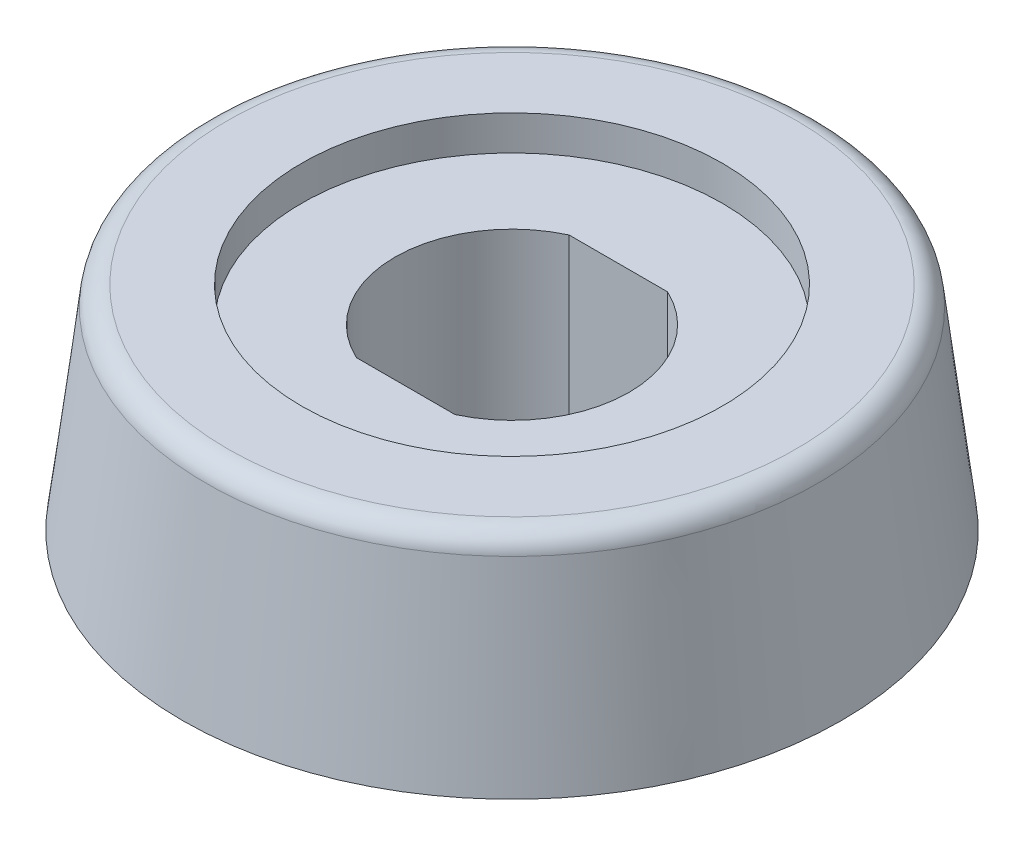
ISO-10303-21;
HEADER;
FILE_DESCRIPTION(('STEP AP214'),'2;1');
FILE_NAME('part.step','',(''),(''),'','','');
FILE_SCHEMA(('AUTOMOTIVE_DESIGN { 1 0 10303 214 1 1 1 1 }'));
ENDSEC;
DATA;
#1=APPLICATION_CONTEXT('core data for automotive mechanical design processes');
#2=APPLICATION_PROTOCOL_DEFINITION('international standard','automotive_design',2000,#1);
#3=PRODUCT_CONTEXT('',#1,'mechanical');
#4=PRODUCT('Part','Part','',(#3));
#5=PRODUCT_RELATED_PRODUCT_CATEGORY('part','',(#4));
#6=PRODUCT_DEFINITION_FORMATION('','',#4);
#7=PRODUCT_DEFINITION_CONTEXT('part definition',#1,'design');
#8=PRODUCT_DEFINITION('design','',#6,#7);
#9=PRODUCT_DEFINITION_SHAPE('','',#8);
#10=(LENGTH_UNIT() NAMED_UNIT(*) SI_UNIT(.MILLI.,.METRE.));
#11=(NAMED_UNIT(*) PLANE_ANGLE_UNIT() SI_UNIT($,.RADIAN.));
#12=(NAMED_UNIT(*) SI_UNIT($,.STERADIAN.) SOLID_ANGLE_UNIT());
#13=UNCERTAINTY_MEASURE_WITH_UNIT(LENGTH_MEASURE(1.E-05),#10,'distance_accuracy_value','');
#14=(GEOMETRIC_REPRESENTATION_CONTEXT(3) GLOBAL_UNCERTAINTY_ASSIGNED_CONTEXT((#13)) GLOBAL_UNIT_ASSIGNED_CONTEXT((#10,
#11,#12)) REPRESENTATION_CONTEXT('',''));
#15=CARTESIAN_POINT('',(0.,0.,0.));
#16=DIRECTION('',(0.,0.,1.));
#17=DIRECTION('',(1.,0.,0.));
#18=AXIS2_PLACEMENT_3D('',#15,#16,#17);
#19=CARTESIAN_POINT('',(-9.325,0.,0.));
#20=DIRECTION('',(0.,-1.,0.));
#21=DIRECTION('',(0.,0.,-1.));
#22=AXIS2_PLACEMENT_3D('',#19,#20,#21);
#23=PLANE('',#22);
#24=CARTESIAN_POINT('',(-9.325,0.,0.));
#25=DIRECTION('',(0.,-1.,0.));
#26=DIRECTION('',(0.,0.,-1.));
#27=AXIS2_PLACEMENT_3D('',#24,#25,#26);
#28=CIRCLE('',#27,5.8);
#29=CARTESIAN_POINT('',(-9.325,0.,-5.8));
#30=VERTEX_POINT('',#29);
#31=EDGE_CURVE('E136',#30,#30,#28,.T.);
#32=ORIENTED_EDGE('',*,*,#31,.F.);
#33=EDGE_LOOP('',(#32));
#34=FACE_BOUND('',#33,.T.);
#35=CARTESIAN_POINT('',(-9.325,0.,0.));
#36=DIRECTION('',(0.,-1.,0.));
#37=DIRECTION('',(0.,0.,-1.));
#38=AXIS2_PLACEMENT_3D('',#35,#36,#37);
#39=CIRCLE('',#38,7.6);
#40=CARTESIAN_POINT('',(-9.325,0.,-7.6));
#41=VERTEX_POINT('',#40);
#42=EDGE_CURVE('E207',#41,#41,#39,.T.);
#43=ORIENTED_EDGE('',*,*,#42,.T.);
#44=EDGE_LOOP('',(#43));
#45=FACE_BOUND('',#44,.T.);
#46=ADVANCED_FACE('F68',(#34,#45),#23,.T.);
#47=CARTESIAN_POINT('',(-9.325,4.9,0.));
#48=DIRECTION('',(0.,-1.,0.));
#49=DIRECTION('',(0.,0.,-1.));
#50=AXIS2_PLACEMENT_3D('',#47,#48,#49);
#51=PLANE('',#50);
#52=CARTESIAN_POINT('',(-9.325,4.9,0.));
#53=DIRECTION('',(0.,-1.,0.));
#54=DIRECTION('',(0.,0.,-1.));
#55=AXIS2_PLACEMENT_3D('',#52,#53,#54);
#56=CIRCLE('',#55,6.55599301929779);
#57=CARTESIAN_POINT('',(-9.325,4.9,-6.55599301929779));
#58=VERTEX_POINT('',#57);
#59=EDGE_CURVE('E13',#58,#58,#56,.F.);
#60=ORIENTED_EDGE('',*,*,#59,.T.);
#61=EDGE_LOOP('',(#60));
#62=FACE_BOUND('',#61,.T.);
#63=CARTESIAN_POINT('',(-9.325,4.9,0.));
#64=DIRECTION('',(0.,-1.,0.));
#65=DIRECTION('',(0.,0.,-1.));
#66=AXIS2_PLACEMENT_3D('',#63,#64,#65);
#67=CIRCLE('',#66,4.85);
#68=CARTESIAN_POINT('',(-9.325,4.9,-4.85));
#69=VERTEX_POINT('',#68);
#70=EDGE_CURVE('E129',#69,#69,#67,.T.);
#71=ORIENTED_EDGE('',*,*,#70,.T.);
#72=EDGE_LOOP('',(#71));
#73=FACE_BOUND('',#72,.T.);
#74=ADVANCED_FACE('F157',(#62,#73),#51,.F.);
#75=CARTESIAN_POINT('',(-9.325,-0.3,0.));
#76=DIRECTION('',(0.,1.,0.));
#77=DIRECTION('',(0.,0.,1.));
#78=AXIS2_PLACEMENT_3D('',#75,#76,#77);
#79=CYLINDRICAL_SURFACE('',#78,5.8);
#80=CARTESIAN_POINT('',(-9.325,-0.3,0.));
#81=DIRECTION('',(0.,-1.,0.));
#82=DIRECTION('',(0.,0.,-1.));
#83=AXIS2_PLACEMENT_3D('',#80,#81,#82);
#84=CIRCLE('',#83,5.8);
#85=CARTESIAN_POINT('',(-9.325,-0.3,-5.8));
#86=VERTEX_POINT('',#85);
#87=EDGE_CURVE('E133',#86,#86,#84,.T.);
#88=ORIENTED_EDGE('',*,*,#87,.F.);
#89=EDGE_LOOP('',(#88));
#90=FACE_BOUND('',#89,.T.);
#91=ORIENTED_EDGE('',*,*,#31,.T.);
#92=EDGE_LOOP('',(#91));
#93=FACE_BOUND('',#92,.T.);
#94=ADVANCED_FACE('F162',(#90,#93),#79,.T.);
#95=CARTESIAN_POINT('',(-9.325,-0.3,0.));
#96=DIRECTION('',(0.,-1.,0.));
#97=DIRECTION('',(0.,0.,-1.));
#98=AXIS2_PLACEMENT_3D('',#95,#96,#97);
#99=PLANE('',#98);
#100=CARTESIAN_POINT('',(-9.325,-0.3,0.));
#101=DIRECTION('',(0.,-1.,0.));
#102=DIRECTION('',(0.,0.,-1.));
#103=AXIS2_PLACEMENT_3D('',#100,#101,#102);
#104=CIRCLE('',#103,3.415);
#105=CARTESIAN_POINT('',(-9.325,-0.3,-3.415));
#106=VERTEX_POINT('',#105);
#107=EDGE_CURVE('E204',#106,#106,#104,.T.);
#108=ORIENTED_EDGE('',*,*,#107,.F.);
#109=EDGE_LOOP('',(#108));
#110=FACE_BOUND('',#109,.T.);
#111=ORIENTED_EDGE('',*,*,#87,.T.);
#112=EDGE_LOOP('',(#111));
#113=FACE_BOUND('',#112,.T.);
#114=ADVANCED_FACE('F170',(#110,#113),#99,.T.);
#115=CARTESIAN_POINT('',(-9.325,-0.3,0.));
#116=DIRECTION('',(0.,1.,0.));
#117=DIRECTION('',(0.,0.,1.));
#118=AXIS2_PLACEMENT_3D('',#115,#116,#117);
#119=CYLINDRICAL_SURFACE('',#118,2.7);
#120=DIRECTION('',(0.,1.,0.));
#121=VECTOR('',#120,1.);
#122=CARTESIAN_POINT('',(-10.459680571791,-0.3,2.45));
#123=LINE('',#122,#121);
#124=CARTESIAN_POINT('',(-10.459680571791,0.,2.45));
#125=VERTEX_POINT('',#124);
#126=CARTESIAN_POINT('',(-10.459680571791,4.1,2.45));
#127=VERTEX_POINT('',#126);
#128=EDGE_CURVE('E125',#125,#127,#123,.T.);
#129=ORIENTED_EDGE('',*,*,#128,.F.);
#130=CARTESIAN_POINT('',(-9.325,0.,0.));
#131=DIRECTION('',(0.,1.,0.));
#132=DIRECTION('',(0.,0.,1.));
#133=AXIS2_PLACEMENT_3D('',#130,#131,#132);
#134=CIRCLE('',#133,2.7);
#135=CARTESIAN_POINT('',(-10.459680571791,0.,-2.45));
#136=VERTEX_POINT('',#135);
#137=EDGE_CURVE('E83',#125,#136,#134,.F.);
#138=ORIENTED_EDGE('',*,*,#137,.T.);
#139=DIRECTION('',(0.,1.,0.));
#140=VECTOR('',#139,1.);
#141=CARTESIAN_POINT('',(-10.459680571791,-0.3,-2.45));
#142=LINE('',#141,#140);
#143=CARTESIAN_POINT('',(-10.459680571791,4.1,-2.45));
#144=VERTEX_POINT('',#143);
#145=EDGE_CURVE('E127',#136,#144,#142,.T.);
#146=ORIENTED_EDGE('',*,*,#145,.T.);
#147=CARTESIAN_POINT('',(-9.325,4.1,0.));
#148=DIRECTION('',(0.,-1.,0.));
#149=DIRECTION('',(0.,0.,-1.));
#150=AXIS2_PLACEMENT_3D('',#147,#148,#149);
#151=CIRCLE('',#150,2.7);
#152=EDGE_CURVE('E141',#144,#127,#151,.F.);
#153=ORIENTED_EDGE('',*,*,#152,.T.);
#154=EDGE_LOOP('',(#129,#138,#146,#153));
#155=FACE_BOUND('',#154,.T.);
#156=ADVANCED_FACE('F174',(#155),#119,.F.);
#157=CARTESIAN_POINT('',(-8.19031942820898,-0.3,-2.45));
#158=DIRECTION('',(0.,0.,-1.));
#159=DIRECTION('',(-1.,0.,0.));
#160=AXIS2_PLACEMENT_3D('',#157,#158,#159);
#161=PLANE('',#160);
#162=ORIENTED_EDGE('',*,*,#145,.F.);
#163=DIRECTION('',(1.,0.,0.));
#164=VECTOR('',#163,1.);
#165=CARTESIAN_POINT('',(-8.19031942820898,0.,-2.45));
#166=LINE('',#165,#164);
#167=CARTESIAN_POINT('',(-8.19031942820898,0.,-2.45));
#168=VERTEX_POINT('',#167);
#169=EDGE_CURVE('E119',#136,#168,#166,.T.);
#170=ORIENTED_EDGE('',*,*,#169,.T.);
#171=DIRECTION('',(0.,1.,0.));
#172=VECTOR('',#171,1.);
#173=CARTESIAN_POINT('',(-8.19031942820898,-0.3,-2.45));
#174=LINE('',#173,#172);
#175=CARTESIAN_POINT('',(-8.19031942820898,4.1,-2.45));
#176=VERTEX_POINT('',#175);
#177=EDGE_CURVE('E118',#168,#176,#174,.T.);
#178=ORIENTED_EDGE('',*,*,#177,.T.);
#179=DIRECTION('',(-1.,0.,0.));
#180=VECTOR('',#179,1.);
#181=CARTESIAN_POINT('',(-8.19031942820898,4.1,-2.45));
#182=LINE('',#181,#180);
#183=EDGE_CURVE('E218',#176,#144,#182,.T.);
#184=ORIENTED_EDGE('',*,*,#183,.T.);
#185=EDGE_LOOP('',(#162,#170,#178,#184));
#186=FACE_BOUND('',#185,.T.);
#187=ADVANCED_FACE('F178',(#186),#161,.F.);
#188=CARTESIAN_POINT('',(-9.325,-0.3,0.));
#189=DIRECTION('',(0.,1.,0.));
#190=DIRECTION('',(0.,0.,1.));
#191=AXIS2_PLACEMENT_3D('',#188,#189,#190);
#192=CYLINDRICAL_SURFACE('',#191,2.7);
#193=ORIENTED_EDGE('',*,*,#177,.F.);
#194=CARTESIAN_POINT('',(-9.325,0.,0.));
#195=DIRECTION('',(0.,1.,0.));
#196=DIRECTION('',(0.,0.,1.));
#197=AXIS2_PLACEMENT_3D('',#194,#195,#196);
#198=CIRCLE('',#197,2.7);
#199=CARTESIAN_POINT('',(-8.19031942820897,0.,2.45));
#200=VERTEX_POINT('',#199);
#201=EDGE_CURVE('E110',#168,#200,#198,.F.);
#202=ORIENTED_EDGE('',*,*,#201,.T.);
#203=DIRECTION('',(0.,1.,0.));
#204=VECTOR('',#203,1.);
#205=CARTESIAN_POINT('',(-8.19031942820897,-0.3,2.45));
#206=LINE('',#205,#204);
#207=CARTESIAN_POINT('',(-8.19031942820897,4.1,2.45));
#208=VERTEX_POINT('',#207);
#209=EDGE_CURVE('E91',#200,#208,#206,.T.);
#210=ORIENTED_EDGE('',*,*,#209,.T.);
#211=CARTESIAN_POINT('',(-9.325,4.1,0.));
#212=DIRECTION('',(0.,-1.,0.));
#213=DIRECTION('',(0.,0.,-1.));
#214=AXIS2_PLACEMENT_3D('',#211,#212,#213);
#215=CIRCLE('',#214,2.7);
#216=EDGE_CURVE('E216',#208,#176,#215,.F.);
#217=ORIENTED_EDGE('',*,*,#216,.T.);
#218=EDGE_LOOP('',(#193,#202,#210,#217));
#219=FACE_BOUND('',#218,.T.);
#220=ADVANCED_FACE('F117',(#219),#192,.F.);
#221=CARTESIAN_POINT('',(-10.459680571791,-0.3,2.45));
#222=DIRECTION('',(0.,0.,1.));
#223=DIRECTION('',(1.,0.,0.));
#224=AXIS2_PLACEMENT_3D('',#221,#222,#223);
#225=PLANE('',#224);
#226=ORIENTED_EDGE('',*,*,#209,.F.);
#227=DIRECTION('',(-1.,0.,0.));
#228=VECTOR('',#227,1.);
#229=CARTESIAN_POINT('',(-10.459680571791,0.,2.45));
#230=LINE('',#229,#228);
#231=EDGE_CURVE('E108',#200,#125,#230,.T.);
#232=ORIENTED_EDGE('',*,*,#231,.T.);
#233=ORIENTED_EDGE('',*,*,#128,.T.);
#234=DIRECTION('',(1.,0.,0.));
#235=VECTOR('',#234,1.);
#236=CARTESIAN_POINT('',(-10.459680571791,4.1,2.45));
#237=LINE('',#236,#235);
#238=EDGE_CURVE('E114',#127,#208,#237,.T.);
#239=ORIENTED_EDGE('',*,*,#238,.T.);
#240=EDGE_LOOP('',(#226,#232,#233,#239));
#241=FACE_BOUND('',#240,.T.);
#242=ADVANCED_FACE('F123',(#241),#225,.F.);
#243=CARTESIAN_POINT('',(-9.325,5.,0.));
#244=DIRECTION('',(0.,-1.,0.));
#245=DIRECTION('',(0.,0.,-1.));
#246=AXIS2_PLACEMENT_3D('',#243,#244,#245);
#247=CYLINDRICAL_SURFACE('',#246,4.85);
#248=CARTESIAN_POINT('',(-9.325,4.1,0.));
#249=DIRECTION('',(0.,-1.,0.));
#250=DIRECTION('',(0.,0.,-1.));
#251=AXIS2_PLACEMENT_3D('',#248,#249,#250);
#252=CIRCLE('',#251,4.85);
#253=CARTESIAN_POINT('',(-9.325,4.1,-4.85));
#254=VERTEX_POINT('',#253);
#255=EDGE_CURVE('E213',#254,#254,#252,.T.);
#256=ORIENTED_EDGE('',*,*,#255,.T.);
#257=EDGE_LOOP('',(#256));
#258=FACE_BOUND('',#257,.T.);
#259=ORIENTED_EDGE('',*,*,#70,.F.);
#260=EDGE_LOOP('',(#259));
#261=FACE_BOUND('',#260,.T.);
#262=ADVANCED_FACE('F182',(#258,#261),#247,.F.);
#263=CARTESIAN_POINT('',(-9.325,4.1,0.));
#264=DIRECTION('',(0.,-1.,0.));
#265=DIRECTION('',(0.,0.,-1.));
#266=AXIS2_PLACEMENT_3D('',#263,#264,#265);
#267=PLANE('',#266);
#268=ORIENTED_EDGE('',*,*,#255,.F.);
#269=EDGE_LOOP('',(#268));
#270=FACE_BOUND('',#269,.T.);
#271=ORIENTED_EDGE('',*,*,#183,.F.);
#272=ORIENTED_EDGE('',*,*,#216,.F.);
#273=ORIENTED_EDGE('',*,*,#238,.F.);
#274=ORIENTED_EDGE('',*,*,#152,.F.);
#275=EDGE_LOOP('',(#271,#272,#273,#274));
#276=FACE_BOUND('',#275,.T.);
#277=ADVANCED_FACE('F190',(#270,#276),#267,.F.);
#278=CARTESIAN_POINT('',(-9.325,0.,-3.415));
#279=DIRECTION('',(0.,1.,0.));
#280=DIRECTION('',(0.,0.,1.));
#281=AXIS2_PLACEMENT_3D('',#278,#279,#280);
#282=PLANE('',#281);
#283=CARTESIAN_POINT('',(-9.325,0.,0.));
#284=DIRECTION('',(0.,-1.,0.));
#285=DIRECTION('',(0.,0.,-1.));
#286=AXIS2_PLACEMENT_3D('',#283,#284,#285);
#287=CIRCLE('',#286,3.415);
#288=CARTESIAN_POINT('',(-9.325,0.,-3.415));
#289=VERTEX_POINT('',#288);
#290=EDGE_CURVE('E120',#289,#289,#287,.T.);
#291=ORIENTED_EDGE('',*,*,#290,.T.);
#292=EDGE_LOOP('',(#291));
#293=FACE_BOUND('',#292,.T.);
#294=ORIENTED_EDGE('',*,*,#231,.F.);
#295=ORIENTED_EDGE('',*,*,#201,.F.);
#296=ORIENTED_EDGE('',*,*,#169,.F.);
#297=ORIENTED_EDGE('',*,*,#137,.F.);
#298=EDGE_LOOP('',(#294,#295,#296,#297));
#299=FACE_BOUND('',#298,.T.);
#300=ADVANCED_FACE('F109',(#293,#299),#282,.F.);
#301=CARTESIAN_POINT('',(-9.325,0.,0.));
#302=DIRECTION('',(0.,-1.,0.));
#303=DIRECTION('',(0.,0.,-1.));
#304=AXIS2_PLACEMENT_3D('',#301,#302,#303);
#305=CYLINDRICAL_SURFACE('',#304,3.415);
#306=ORIENTED_EDGE('',*,*,#290,.F.);
#307=EDGE_LOOP('',(#306));
#308=FACE_BOUND('',#307,.T.);
#309=ORIENTED_EDGE('',*,*,#107,.T.);
#310=EDGE_LOOP('',(#309));
#311=FACE_BOUND('',#310,.T.);
#312=ADVANCED_FACE('F153',(#308,#311),#305,.F.);
#313=CARTESIAN_POINT('',(-9.325,0.,0.));
#314=DIRECTION('',(0.,-1.,0.));
#315=DIRECTION('',(0.,0.,-1.));
#316=AXIS2_PLACEMENT_3D('',#313,#314,#315);
#317=CONICAL_SURFACE('',#316,7.6,0.122173047639603);
#318=CARTESIAN_POINT('',(-9.325,4.46093467170258,0.));
#319=DIRECTION('',(0.,-1.,0.));
#320=DIRECTION('',(0.,0.,-1.));
#321=AXIS2_PLACEMENT_3D('',#318,#319,#320);
#322=CIRCLE('',#321,7.05226609511846);
#323=CARTESIAN_POINT('',(-9.325,4.46093467170258,-7.05226609511845));
#324=VERTEX_POINT('',#323);
#325=EDGE_CURVE('E76',#324,#324,#322,.T.);
#326=ORIENTED_EDGE('',*,*,#325,.T.);
#327=EDGE_LOOP('',(#326));
#328=FACE_BOUND('',#327,.T.);
#329=ORIENTED_EDGE('',*,*,#42,.F.);
#330=EDGE_LOOP('',(#329));
#331=FACE_BOUND('',#330,.T.);
#332=ADVANCED_FACE('F145',(#328,#331),#317,.T.);
#333=CARTESIAN_POINT('',(-9.325,4.4,0.));
#334=DIRECTION('',(0.,-1.,0.));
#335=DIRECTION('',(0.,0.,-1.));
#336=AXIS2_PLACEMENT_3D('',#333,#334,#335);
#337=TOROIDAL_SURFACE('',#336,6.55599301929779,0.5);
#338=ORIENTED_EDGE('',*,*,#59,.F.);
#339=EDGE_LOOP('',(#338));
#340=FACE_BOUND('',#339,.T.);
#341=ORIENTED_EDGE('',*,*,#325,.F.);
#342=EDGE_LOOP('',(#341));
#343=FACE_BOUND('',#342,.T.);
#344=ADVANCED_FACE('F70',(#340,#343),#337,.T.);
#345=CLOSED_SHELL('',(#46,#74,#94,#114,#156,#187,#220,#242,#262,#277,#300,#312,#332,#344));
#346=MANIFOLD_SOLID_BREP('B2',#345);
#347=ADVANCED_BREP_SHAPE_REPRESENTATION('',(#18,#346),#14);
#348=SHAPE_DEFINITION_REPRESENTATION(#9,#347);
ENDSEC;
END-ISO-10303-21;
